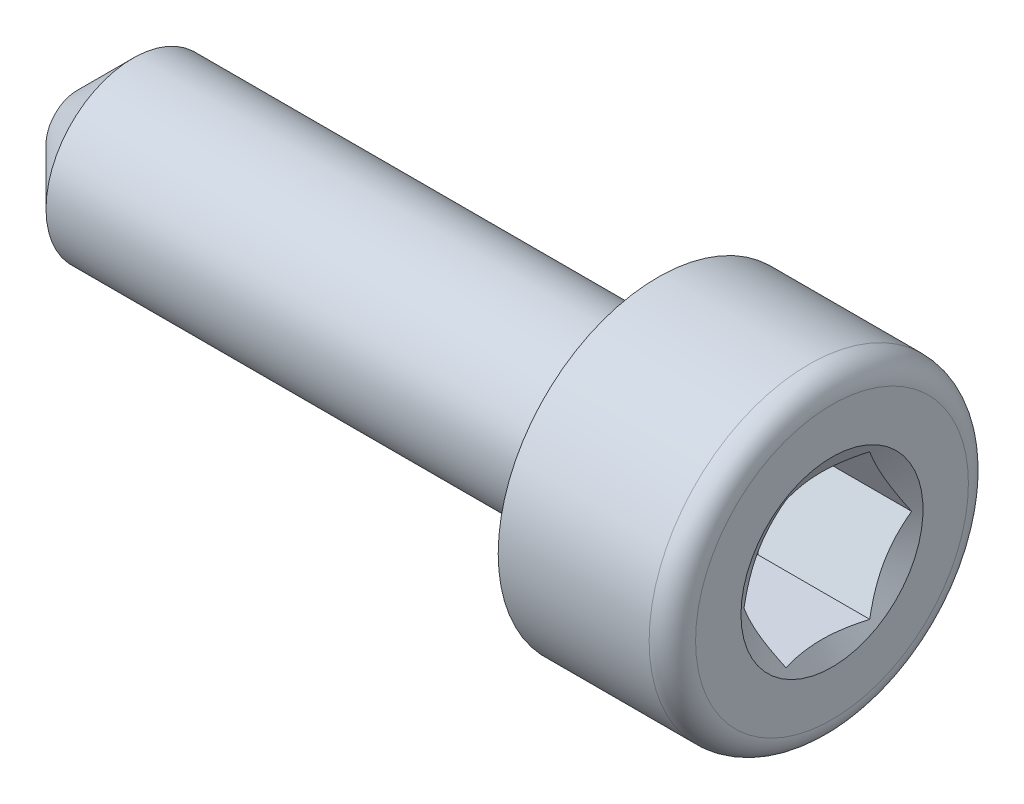
ISO-10303-21;
HEADER;
FILE_DESCRIPTION(('STEP AP214'),'2;1');
FILE_NAME('part.step','',(''),(''),'','','');
FILE_SCHEMA(('AUTOMOTIVE_DESIGN { 1 0 10303 214 1 1 1 1 }'));
ENDSEC;
DATA;
#1=APPLICATION_CONTEXT('core data for automotive mechanical design processes');
#2=APPLICATION_PROTOCOL_DEFINITION('international standard','automotive_design',2000,#1);
#3=PRODUCT_CONTEXT('',#1,'mechanical');
#4=PRODUCT('Part','Part','',(#3));
#5=PRODUCT_RELATED_PRODUCT_CATEGORY('part','',(#4));
#6=PRODUCT_DEFINITION_FORMATION('','',#4);
#7=PRODUCT_DEFINITION_CONTEXT('part definition',#1,'design');
#8=PRODUCT_DEFINITION('design','',#6,#7);
#9=PRODUCT_DEFINITION_SHAPE('','',#8);
#10=(LENGTH_UNIT() NAMED_UNIT(*) SI_UNIT(.MILLI.,.METRE.));
#11=(NAMED_UNIT(*) PLANE_ANGLE_UNIT() SI_UNIT($,.RADIAN.));
#12=(NAMED_UNIT(*) SI_UNIT($,.STERADIAN.) SOLID_ANGLE_UNIT());
#13=UNCERTAINTY_MEASURE_WITH_UNIT(LENGTH_MEASURE(1.E-05),#10,'distance_accuracy_value','');
#14=(GEOMETRIC_REPRESENTATION_CONTEXT(3) GLOBAL_UNCERTAINTY_ASSIGNED_CONTEXT((#13)) GLOBAL_UNIT_ASSIGNED_CONTEXT((#10,
#11,#12)) REPRESENTATION_CONTEXT('',''));
#15=CARTESIAN_POINT('',(0.,0.,0.));
#16=DIRECTION('',(0.,0.,1.));
#17=DIRECTION('',(1.,0.,0.));
#18=AXIS2_PLACEMENT_3D('',#15,#16,#17);
#19=CARTESIAN_POINT('',(68.6597400940086,-52.83000020762,146.720000096603));
#20=DIRECTION('',(1.,0.,0.));
#21=DIRECTION('',(0.,0.,-1.));
#22=AXIS2_PLACEMENT_3D('',#19,#20,#21);
#23=CONICAL_SURFACE('',#22,1.16376043070346,1.0471975511966);
#24=CARTESIAN_POINT('',(68.5212187011892,-52.82987220762,147.643834428141));
#25=CARTESIAN_POINT('',(68.5094934136353,-52.8650295227385,147.623536342794));
#26=CARTESIAN_POINT('',(68.4988293440446,-52.9004903107254,147.603063047304));
#27=CARTESIAN_POINT('',(68.4802143030994,-52.9720260427197,147.56176187318));
#28=CARTESIAN_POINT('',(68.4722699184489,-53.0081022586699,147.54093326019));
#29=CARTESIAN_POINT('',(68.4599022297053,-53.0798075510724,147.499534190319));
#30=CARTESIAN_POINT('',(68.4553966307068,-53.1154255890437,147.478970106508));
#31=CARTESIAN_POINT('',(68.4500159862293,-53.1868294261116,147.437745081956));
#32=CARTESIAN_POINT('',(68.4491364871196,-53.2226149653376,147.417084291251));
#33=CARTESIAN_POINT('',(68.450957365331,-53.2894932771785,147.378472079907));
#34=CARTESIAN_POINT('',(68.4532106526512,-53.3205960155447,147.360514905538));
#35=CARTESIAN_POINT('',(68.4603549815272,-53.3825988394103,147.324717558489));
#36=CARTESIAN_POINT('',(68.4652484681686,-53.4134987101429,147.306877509804));
#37=CARTESIAN_POINT('',(68.4774828804124,-53.4756295732868,147.271006239242));
#38=CARTESIAN_POINT('',(68.4848757138705,-53.5068526942453,147.252979561952));
#39=CARTESIAN_POINT('',(68.5016549508066,-53.5688330090869,147.217195210494));
#40=CARTESIAN_POINT('',(68.511037406771,-53.5995909982291,147.199437077183));
#41=CARTESIAN_POINT('',(68.5212187011892,-53.63012820762,147.181806411121));
#42=B_SPLINE_CURVE_WITH_KNOTS('',3,(#24,#25,#26,#27,#28,#29,#30,#31,#32,#33,#34,#35,#36,#37,#38,
#39,#40,#41),.UNSPECIFIED.,.F.,.F.,(4,2,2,2,2,2,2,2,4),(0.,0.126816525492999,0.253938045715125,
0.377912715180204,0.501735071636374,0.609587236168516,0.717539454345454,0.827887554272333,
0.938018732725722),.UNSPECIFIED.);
#43=CARTESIAN_POINT('',(68.521176029403,-52.83000020762,147.643760527307));
#44=VERTEX_POINT('',#43);
#45=CARTESIAN_POINT('',(68.521176029403,-53.63000020762,147.181880311955));
#46=VERTEX_POINT('',#45);
#47=EDGE_CURVE('E160',#44,#46,#42,.T.);
#48=ORIENTED_EDGE('',*,*,#47,.F.);
#49=CARTESIAN_POINT('',(68.5212187011892,-52.02987220762,147.181806411121));
#50=CARTESIAN_POINT('',(68.5094934136352,-52.0650295227386,147.202104496468));
#51=CARTESIAN_POINT('',(68.4988293440446,-52.1004903107254,147.222577791958));
#52=CARTESIAN_POINT('',(68.4802143030994,-52.1720260427198,147.263878966082));
#53=CARTESIAN_POINT('',(68.4722699184489,-52.2081022586699,147.284707579072));
#54=CARTESIAN_POINT('',(68.4599022297053,-52.2798075510725,147.326106648943));
#55=CARTESIAN_POINT('',(68.4553966307068,-52.3154255890438,147.346670732754));
#56=CARTESIAN_POINT('',(68.4500159862293,-52.3868294261117,147.387895757306));
#57=CARTESIAN_POINT('',(68.4491364871196,-52.4226149653377,147.408556548011));
#58=CARTESIAN_POINT('',(68.450957365331,-52.4894932771785,147.447168759356));
#59=CARTESIAN_POINT('',(68.4532106526512,-52.5205960155447,147.465125933724));
#60=CARTESIAN_POINT('',(68.4603549815272,-52.5825988394104,147.500923280773));
#61=CARTESIAN_POINT('',(68.4652484681686,-52.6134987101429,147.518763329458));
#62=CARTESIAN_POINT('',(68.4774828804124,-52.6756295732868,147.55463460002));
#63=CARTESIAN_POINT('',(68.4848757138705,-52.7068526942454,147.57266127731));
#64=CARTESIAN_POINT('',(68.5016549508066,-52.7688330090869,147.608445628768));
#65=CARTESIAN_POINT('',(68.511037406771,-52.7995909982291,147.626203762079));
#66=CARTESIAN_POINT('',(68.5212187011892,-52.83012820762,147.643834428141));
#67=B_SPLINE_CURVE_WITH_KNOTS('',3,(#49,#50,#51,#52,#53,#54,#55,#56,#57,#58,#59,#60,#61,#62,#63,
#64,#65,#66),.UNSPECIFIED.,.F.,.F.,(4,2,2,2,2,2,2,2,4),(0.,0.126816525493006,0.253938045715146,
0.377912715180235,0.501735071636427,0.609587236168529,0.717539454345456,0.827887554272352,
0.938018732725727),.UNSPECIFIED.);
#68=CARTESIAN_POINT('',(68.521176029403,-52.03000020762,147.181880311955));
#69=VERTEX_POINT('',#68);
#70=EDGE_CURVE('E11',#69,#44,#67,.T.);
#71=ORIENTED_EDGE('',*,*,#70,.F.);
#72=CARTESIAN_POINT('',(68.8241606292654,-52.03000020762,145.512406184663));
#73=CARTESIAN_POINT('',(68.8074657797416,-52.03000020762,145.547098522122));
#74=CARTESIAN_POINT('',(68.7909438843836,-52.03000020762,145.581873715875));
#75=CARTESIAN_POINT('',(68.7583365008573,-52.03000020762,145.651635233733));
#76=CARTESIAN_POINT('',(68.7422510890022,-52.03000020762,145.686621593468));
#77=CARTESIAN_POINT('',(68.6946083505296,-52.03000020762,145.792359507952));
#78=CARTESIAN_POINT('',(68.6638627236597,-52.03000020762,145.863483601709));
#79=CARTESIAN_POINT('',(68.6049839350816,-52.03000020762,146.009097983156));
#80=CARTESIAN_POINT('',(68.5769455311074,-52.03000020762,146.083627095829));
#81=CARTESIAN_POINT('',(68.5269198519533,-52.03000020762,146.234602012306));
#82=CARTESIAN_POINT('',(68.5049171935068,-52.03000020762,146.311042391316));
#83=CARTESIAN_POINT('',(68.4792653748251,-52.03000020762,146.427166410567));
#84=CARTESIAN_POINT('',(68.4719483389723,-52.03000020762,146.466029858478));
#85=CARTESIAN_POINT('',(68.460240914597,-52.03000020762,146.544204222171));
#86=CARTESIAN_POINT('',(68.4558503032918,-52.03000020762,146.58351510366));
#87=CARTESIAN_POINT('',(68.450402515354,-52.03000020762,146.661889349208));
#88=CARTESIAN_POINT('',(68.4493051409598,-52.03000020762,146.700949841373));
#89=CARTESIAN_POINT('',(68.4504288996582,-52.03000020762,146.779021773734));
#90=CARTESIAN_POINT('',(68.4526502202642,-52.03000020762,146.818033211034));
#91=CARTESIAN_POINT('',(68.4619659889334,-52.03000020762,146.913651013071));
#92=CARTESIAN_POINT('',(68.4708337598779,-52.03000020762,146.970085111015));
#93=CARTESIAN_POINT('',(68.493872845829,-52.03000020762,147.081870094715));
#94=CARTESIAN_POINT('',(68.5080504424478,-52.03000020762,147.137219615462));
#95=CARTESIAN_POINT('',(68.5405556851422,-52.03000020762,147.24802020667));
#96=CARTESIAN_POINT('',(68.558970085919,-52.03000020762,147.303445161441));
#97=CARTESIAN_POINT('',(68.5985233136134,-52.03000020762,147.413273679359));
#98=CARTESIAN_POINT('',(68.6196612381874,-52.03000020762,147.467677573989));
#99=CARTESIAN_POINT('',(68.6770129359438,-52.03000020762,147.608042163006));
#100=CARTESIAN_POINT('',(68.7146784839061,-52.03000020762,147.693403749214));
#101=CARTESIAN_POINT('',(68.7927399564154,-52.03000020762,147.8628710916));
#102=CARTESIAN_POINT('',(68.8331366567816,-52.03000020762,147.946976482584));
#103=CARTESIAN_POINT('',(68.9156710494868,-52.03000020762,148.11445236961));
#104=CARTESIAN_POINT('',(68.9578107974321,-52.03000020762,148.197821848631));
#105=CARTESIAN_POINT('',(69.0431925782374,-52.03000020762,148.363994931639));
#106=CARTESIAN_POINT('',(69.0864346495305,-52.03000020762,148.446798515767));
#107=CARTESIAN_POINT('',(69.1694321118793,-52.03000020762,148.603976195432));
#108=CARTESIAN_POINT('',(69.2091177782604,-52.03000020762,148.678387188479));
#109=CARTESIAN_POINT('',(69.2889422738617,-52.03000020762,148.826969296118));
#110=CARTESIAN_POINT('',(69.3290811215113,-52.03000020762,148.901140400797));
#111=CARTESIAN_POINT('',(69.4095892829879,-52.03000020762,149.049099090897));
#112=CARTESIAN_POINT('',(69.4499576881449,-52.03000020762,149.122887171336));
#113=CARTESIAN_POINT('',(69.530956500967,-52.03000020762,149.270314044254));
#114=CARTESIAN_POINT('',(69.5715868937745,-52.03000020762,149.343952844893));
#115=CARTESIAN_POINT('',(69.6123130966146,-52.03000020762,149.417538279232));
#116=B_SPLINE_CURVE_WITH_KNOTS('',3,(#72,#73,#74,#75,#76,#77,#78,#79,#80,#81,#82,#83,#84,#85,
#86,#87,#88,#89,#90,#91,#92,#93,#94,#95,#96,#97,#98,#99,#100,#101,#102,#103,#104,#105,#106,#107,
#108,#109,#110,#111,#112,#113,#114,#115),.UNSPECIFIED.,.F.,.F.,(4,2,2,2,2,2,2,2,2,2,2,2,2,2,2,2,
2,2,2,2,2,4),(0.,0.115499206954029,0.231018478934879,0.463412816308572,0.70217981961546,
0.940332502277009,1.05888018896878,1.17741884983488,1.29450460172914,1.41159696946407,
1.58262285981461,1.75385171904399,1.9289603523422,2.10401111804253,2.38382066740579,
2.66371003699703,2.94393946123019,3.22417866922427,3.47717373812532,3.73017913276501,
3.98250492526783,4.23481653181641),.UNSPECIFIED.);
#117=CARTESIAN_POINT('',(68.521176029403,-52.03000020762,146.258119881252));
#118=VERTEX_POINT('',#117);
#119=EDGE_CURVE('E54',#118,#69,#116,.T.);
#120=ORIENTED_EDGE('',*,*,#119,.F.);
#121=CARTESIAN_POINT('',(68.5212187011892,-52.83012820762,145.796165765066));
#122=CARTESIAN_POINT('',(68.5094934136352,-52.7949708925015,145.816463850413));
#123=CARTESIAN_POINT('',(68.4988293440446,-52.7595101045147,145.836937145903));
#124=CARTESIAN_POINT('',(68.4802143030994,-52.6879743725203,145.878238320027));
#125=CARTESIAN_POINT('',(68.4722699184489,-52.6518981565702,145.899066933017));
#126=CARTESIAN_POINT('',(68.4599022297053,-52.5801928641677,145.940466002888));
#127=CARTESIAN_POINT('',(68.4553966307067,-52.5445748261964,145.961030086699));
#128=CARTESIAN_POINT('',(68.4500159862293,-52.4731709891285,146.002255111251));
#129=CARTESIAN_POINT('',(68.4491364871196,-52.4373854499024,146.022915901956));
#130=CARTESIAN_POINT('',(68.450957365331,-52.3705071380616,146.0615281133));
#131=CARTESIAN_POINT('',(68.4532106526512,-52.3394043996954,146.079485287669));
#132=CARTESIAN_POINT('',(68.4603549815271,-52.2774015758298,146.115282634718));
#133=CARTESIAN_POINT('',(68.4652484681685,-52.2465017050972,146.133122683403));
#134=CARTESIAN_POINT('',(68.4774828804123,-52.1843708419533,146.168993953965));
#135=CARTESIAN_POINT('',(68.4848757138705,-52.1531477209947,146.187020631255));
#136=CARTESIAN_POINT('',(68.5016549508066,-52.0911674061532,146.222804982713));
#137=CARTESIAN_POINT('',(68.511037406771,-52.060409417011,146.240563116024));
#138=CARTESIAN_POINT('',(68.5212187011892,-52.02987220762,146.258193782086));
#139=B_SPLINE_CURVE_WITH_KNOTS('',3,(#121,#122,#123,#124,#125,#126,#127,#128,#129,#130,#131,
#132,#133,#134,#135,#136,#137,#138),.UNSPECIFIED.,.F.,.F.,(4,2,2,2,2,2,2,2,4),(0.,
0.126816525492994,0.253938045715109,0.377912715180201,0.501735071636375,0.609587236168512,
0.717539454345442,0.827887554272372,0.938018732725732),.UNSPECIFIED.);
#140=CARTESIAN_POINT('',(68.521176029403,-52.83000020762,145.7962396659));
#141=VERTEX_POINT('',#140);
#142=EDGE_CURVE('E198',#141,#118,#139,.T.);
#143=ORIENTED_EDGE('',*,*,#142,.F.);
#144=CARTESIAN_POINT('',(68.5212187011892,-53.63012820762,146.258193782086));
#145=CARTESIAN_POINT('',(68.5094934136352,-53.5949708925015,146.237895696739));
#146=CARTESIAN_POINT('',(68.4988293440446,-53.5595101045147,146.217422401249));
#147=CARTESIAN_POINT('',(68.4802143030994,-53.4879743725203,146.176121227125));
#148=CARTESIAN_POINT('',(68.4722699184489,-53.4518981565702,146.155292614135));
#149=CARTESIAN_POINT('',(68.4599022297053,-53.3801928641676,146.113893544264));
#150=CARTESIAN_POINT('',(68.4553966307067,-53.3445748261963,146.093329460453));
#151=CARTESIAN_POINT('',(68.4500159862293,-53.2731709891284,146.052104435901));
#152=CARTESIAN_POINT('',(68.4491364871196,-53.2373854499024,146.031443645196));
#153=CARTESIAN_POINT('',(68.450957365331,-53.1705071380616,145.992831433851));
#154=CARTESIAN_POINT('',(68.4532106526512,-53.1394043996954,145.974874259483));
#155=CARTESIAN_POINT('',(68.4603549815271,-53.0774015758297,145.939076912434));
#156=CARTESIAN_POINT('',(68.4652484681685,-53.0465017050972,145.921236863748));
#157=CARTESIAN_POINT('',(68.4774828804123,-52.9843708419532,145.885365593187));
#158=CARTESIAN_POINT('',(68.4848757138705,-52.9531477209947,145.867338915897));
#159=CARTESIAN_POINT('',(68.5016549508066,-52.8911674061531,145.831554564439));
#160=CARTESIAN_POINT('',(68.511037406771,-52.8604094170109,145.813796431128));
#161=CARTESIAN_POINT('',(68.5212187011892,-52.82987220762,145.796165765066));
#162=B_SPLINE_CURVE_WITH_KNOTS('',3,(#144,#145,#146,#147,#148,#149,#150,#151,#152,#153,#154,
#155,#156,#157,#158,#159,#160,#161),.UNSPECIFIED.,.F.,.F.,(4,2,2,2,2,2,2,2,4),(0.,
0.126816525492994,0.253938045715109,0.377912715180208,0.501735071636387,0.609587236168525,
0.717539454345451,0.827887554272353,0.938018732725731),.UNSPECIFIED.);
#163=CARTESIAN_POINT('',(68.521176029403,-53.63000020762,146.258119881252));
#164=VERTEX_POINT('',#163);
#165=EDGE_CURVE('E192',#164,#141,#162,.T.);
#166=ORIENTED_EDGE('',*,*,#165,.F.);
#167=CARTESIAN_POINT('',(68.8241606292654,-53.63000020762,145.512406184664));
#168=CARTESIAN_POINT('',(68.8074657797416,-53.63000020762,145.547098522122));
#169=CARTESIAN_POINT('',(68.7909438843836,-53.63000020762,145.581873715875));
#170=CARTESIAN_POINT('',(68.7583365008573,-53.63000020762,145.651635233733));
#171=CARTESIAN_POINT('',(68.7422510890022,-53.63000020762,145.686621593468));
#172=CARTESIAN_POINT('',(68.6946083505296,-53.63000020762,145.792359507952));
#173=CARTESIAN_POINT('',(68.6638627236597,-53.63000020762,145.863483601709));
#174=CARTESIAN_POINT('',(68.6049839350816,-53.63000020762,146.009097983157));
#175=CARTESIAN_POINT('',(68.5769455311074,-53.63000020762,146.083627095829));
#176=CARTESIAN_POINT('',(68.5269198519532,-53.63000020762,146.234602012306));
#177=CARTESIAN_POINT('',(68.5049171935067,-53.63000020762,146.311042391316));
#178=CARTESIAN_POINT('',(68.479265374825,-53.63000020762,146.427166410567));
#179=CARTESIAN_POINT('',(68.4719483389722,-53.63000020762,146.466029858478));
#180=CARTESIAN_POINT('',(68.460240914597,-53.63000020762,146.544204222171));
#181=CARTESIAN_POINT('',(68.4558503032918,-53.63000020762,146.58351510366));
#182=CARTESIAN_POINT('',(68.450402515354,-53.63000020762,146.661889349208));
#183=CARTESIAN_POINT('',(68.4493051409598,-53.63000020762,146.700949841373));
#184=CARTESIAN_POINT('',(68.4504288996582,-53.63000020762,146.779021773734));
#185=CARTESIAN_POINT('',(68.4526502202642,-53.63000020762,146.818033211034));
#186=CARTESIAN_POINT('',(68.4619659889334,-53.63000020762,146.913651013071));
#187=CARTESIAN_POINT('',(68.4708337598779,-53.63000020762,146.970085111015));
#188=CARTESIAN_POINT('',(68.493872845829,-53.63000020762,147.081870094716));
#189=CARTESIAN_POINT('',(68.5080504424478,-53.63000020762,147.137219615462));
#190=CARTESIAN_POINT('',(68.5405556851422,-53.63000020762,147.24802020667));
#191=CARTESIAN_POINT('',(68.5589700859191,-53.63000020762,147.303445161441));
#192=CARTESIAN_POINT('',(68.5985233136135,-53.63000020762,147.413273679359));
#193=CARTESIAN_POINT('',(68.6196612381874,-53.63000020762,147.467677573989));
#194=CARTESIAN_POINT('',(68.6770129359438,-53.63000020762,147.608042163006));
#195=CARTESIAN_POINT('',(68.7146784839062,-53.63000020762,147.693403749214));
#196=CARTESIAN_POINT('',(68.7927399564155,-53.6300002076201,147.8628710916));
#197=CARTESIAN_POINT('',(68.8331366567817,-53.63000020762,147.946976482585));
#198=CARTESIAN_POINT('',(68.9156710494868,-53.63000020762,148.11445236961));
#199=CARTESIAN_POINT('',(68.9578107974321,-53.6300002076201,148.197821848631));
#200=CARTESIAN_POINT('',(69.0431925782374,-53.6300002076201,148.363994931639));
#201=CARTESIAN_POINT('',(69.0864346495305,-53.6300002076201,148.446798515767));
#202=CARTESIAN_POINT('',(69.1694321118793,-53.6300002076201,148.603976195432));
#203=CARTESIAN_POINT('',(69.2091177782604,-53.6300002076201,148.678387188479));
#204=CARTESIAN_POINT('',(69.2889422738617,-53.6300002076201,148.826969296118));
#205=CARTESIAN_POINT('',(69.3290811215113,-53.6300002076201,148.901140400797));
#206=CARTESIAN_POINT('',(69.4095892829879,-53.6300002076201,149.049099090897));
#207=CARTESIAN_POINT('',(69.4499576881449,-53.6300002076201,149.122887171336));
#208=CARTESIAN_POINT('',(69.530956500967,-53.6300002076201,149.270314044254));
#209=CARTESIAN_POINT('',(69.5715868937745,-53.63000020762,149.343952844893));
#210=CARTESIAN_POINT('',(69.6123130966146,-53.63000020762,149.417538279232));
#211=B_SPLINE_CURVE_WITH_KNOTS('',3,(#167,#168,#169,#170,#171,#172,#173,#174,#175,#176,#177,
#178,#179,#180,#181,#182,#183,#184,#185,#186,#187,#188,#189,#190,#191,#192,#193,#194,#195,#196,
#197,#198,#199,#200,#201,#202,#203,#204,#205,#206,#207,#208,#209,#210),.UNSPECIFIED.,.F.,.F.,(4,
2,2,2,2,2,2,2,2,2,2,2,2,2,2,2,2,2,2,2,2,4),(0.,0.115499206954021,0.231018478934877,
0.463412816308565,0.702179819615392,0.940332502276902,1.05888018896866,1.17741884983476,
1.29450460172902,1.41159696946395,1.58262285981449,1.75385171904393,1.92896035234214,
2.10401111804251,2.38382066740573,2.66371003699694,2.94393946123004,3.22417866922409,
3.47717373812514,3.73017913276486,3.98250492526769,4.23481653181629),.UNSPECIFIED.);
#212=EDGE_CURVE('E167',#46,#164,#211,.F.);
#213=ORIENTED_EDGE('',*,*,#212,.F.);
#214=EDGE_LOOP('',(#48,#71,#120,#143,#166,#213));
#215=FACE_BOUND('',#214,.T.);
#216=CARTESIAN_POINT('',(68.5673640509382,-52.83000020762,146.720000096603));
#217=DIRECTION('',(-1.,0.,0.));
#218=DIRECTION('',(0.,0.,1.));
#219=AXIS2_PLACEMENT_3D('',#216,#217,#218);
#220=CIRCLE('',#219,1.00376043070342);
#221=CARTESIAN_POINT('',(68.5673640509382,-52.83000020762,147.723760527307));
#222=VERTEX_POINT('',#221);
#223=EDGE_CURVE('E156',#222,#222,#220,.T.);
#224=ORIENTED_EDGE('',*,*,#223,.F.);
#225=EDGE_LOOP('',(#224));
#226=FACE_BOUND('',#225,.T.);
#227=ADVANCED_FACE('F40',(#215,#226),#23,.F.);
#228=CARTESIAN_POINT('',(60.2473640509382,-52.83000020762,147.065600096603));
#229=DIRECTION('',(1.,0.,0.));
#230=DIRECTION('',(0.,0.,-1.));
#231=AXIS2_PLACEMENT_3D('',#228,#229,#230);
#232=PLANE('',#231);
#233=CARTESIAN_POINT('',(60.2473640509382,-52.83000020762,146.720000096603));
#234=DIRECTION('',(-1.,0.,0.));
#235=DIRECTION('',(0.,0.,1.));
#236=AXIS2_PLACEMENT_3D('',#233,#234,#235);
#237=CIRCLE('',#236,0.345600000000026);
#238=CARTESIAN_POINT('',(60.2473640509382,-52.83000020762,147.065600096603));
#239=VERTEX_POINT('',#238);
#240=EDGE_CURVE('E152',#239,#239,#237,.T.);
#241=ORIENTED_EDGE('',*,*,#240,.T.);
#242=EDGE_LOOP('',(#241));
#243=FACE_BOUND('',#242,.T.);
#244=ADVANCED_FACE('F42',(#243),#232,.F.);
#245=CARTESIAN_POINT('',(60.8617640509382,-52.83000020762,146.720000096603));
#246=DIRECTION('',(1.,0.,0.));
#247=DIRECTION('',(0.,0.,-1.));
#248=AXIS2_PLACEMENT_3D('',#245,#246,#247);
#249=CONICAL_SURFACE('',#248,0.96,0.785398163397434);
#250=ORIENTED_EDGE('',*,*,#240,.F.);
#251=EDGE_LOOP('',(#250));
#252=FACE_BOUND('',#251,.T.);
#253=CARTESIAN_POINT('',(60.8617640509382,-52.83000020762,146.720000096603));
#254=DIRECTION('',(-1.,0.,0.));
#255=DIRECTION('',(0.,0.,1.));
#256=AXIS2_PLACEMENT_3D('',#253,#254,#255);
#257=CIRCLE('',#256,0.96);
#258=CARTESIAN_POINT('',(60.8617640509382,-52.83000020762,147.680000096603));
#259=VERTEX_POINT('',#258);
#260=EDGE_CURVE('E148',#259,#259,#257,.T.);
#261=ORIENTED_EDGE('',*,*,#260,.T.);
#262=EDGE_LOOP('',(#261));
#263=FACE_BOUND('',#262,.T.);
#264=ADVANCED_FACE('F223',(#252,#263),#249,.T.);
#265=CARTESIAN_POINT('',(60.2473640509382,-52.83000020762,146.720000096603));
#266=DIRECTION('',(-1.,0.,0.));
#267=DIRECTION('',(0.,0.,1.));
#268=AXIS2_PLACEMENT_3D('',#265,#266,#267);
#269=CYLINDRICAL_SURFACE('',#268,0.96);
#270=ORIENTED_EDGE('',*,*,#260,.F.);
#271=EDGE_LOOP('',(#270));
#272=FACE_BOUND('',#271,.T.);
#273=CARTESIAN_POINT('',(66.5193640509382,-52.83000020762,146.720000096603));
#274=DIRECTION('',(-1.,0.,0.));
#275=DIRECTION('',(0.,0.,1.));
#276=AXIS2_PLACEMENT_3D('',#273,#274,#275);
#277=CIRCLE('',#276,0.96);
#278=CARTESIAN_POINT('',(66.5193640509382,-52.83000020762,147.680000096603));
#279=VERTEX_POINT('',#278);
#280=EDGE_CURVE('E144',#279,#279,#277,.T.);
#281=ORIENTED_EDGE('',*,*,#280,.T.);
#282=EDGE_LOOP('',(#281));
#283=FACE_BOUND('',#282,.T.);
#284=ADVANCED_FACE('F287',(#272,#283),#269,.T.);
#285=CARTESIAN_POINT('',(66.5193640509382,-52.83000020762,146.720000096603));
#286=DIRECTION('',(-1.,0.,0.));
#287=DIRECTION('',(0.,0.,1.));
#288=AXIS2_PLACEMENT_3D('',#285,#286,#287);
#289=TOROIDAL_SURFACE('',#288,1.088,0.128000000000004);
#290=ORIENTED_EDGE('',*,*,#280,.F.);
#291=EDGE_LOOP('',(#290));
#292=FACE_BOUND('',#291,.T.);
#293=CARTESIAN_POINT('',(66.6473640509382,-52.83000020762,146.720000096603));
#294=DIRECTION('',(-1.,0.,0.));
#295=DIRECTION('',(0.,0.,1.));
#296=AXIS2_PLACEMENT_3D('',#293,#294,#295);
#297=CIRCLE('',#296,1.088);
#298=CARTESIAN_POINT('',(66.6473640509382,-52.83000020762,147.808000096603));
#299=VERTEX_POINT('',#298);
#300=EDGE_CURVE('E140',#299,#299,#297,.T.);
#301=ORIENTED_EDGE('',*,*,#300,.T.);
#302=EDGE_LOOP('',(#301));
#303=FACE_BOUND('',#302,.T.);
#304=ADVANCED_FACE('F295',(#292,#303),#289,.F.);
#305=CARTESIAN_POINT('',(66.6473640509382,-52.83000020762,148.480000096603));
#306=DIRECTION('',(1.,0.,0.));
#307=DIRECTION('',(0.,0.,-1.));
#308=AXIS2_PLACEMENT_3D('',#305,#306,#307);
#309=PLANE('',#308);
#310=ORIENTED_EDGE('',*,*,#300,.F.);
#311=EDGE_LOOP('',(#310));
#312=FACE_BOUND('',#311,.T.);
#313=CARTESIAN_POINT('',(66.6473640509382,-52.83000020762,146.720000096603));
#314=DIRECTION('',(-1.,0.,0.));
#315=DIRECTION('',(0.,0.,1.));
#316=AXIS2_PLACEMENT_3D('',#313,#314,#315);
#317=CIRCLE('',#316,1.76);
#318=CARTESIAN_POINT('',(66.6473640509382,-52.83000020762,148.480000096603));
#319=VERTEX_POINT('',#318);
#320=EDGE_CURVE('E136',#319,#319,#317,.T.);
#321=ORIENTED_EDGE('',*,*,#320,.T.);
#322=EDGE_LOOP('',(#321));
#323=FACE_BOUND('',#322,.T.);
#324=ADVANCED_FACE('F306',(#312,#323),#309,.F.);
#325=CARTESIAN_POINT('',(60.2473640509382,-52.83000020762,146.720000096603));
#326=DIRECTION('',(-1.,0.,0.));
#327=DIRECTION('',(0.,0.,1.));
#328=AXIS2_PLACEMENT_3D('',#325,#326,#327);
#329=CYLINDRICAL_SURFACE('',#328,1.76);
#330=ORIENTED_EDGE('',*,*,#320,.F.);
#331=EDGE_LOOP('',(#330));
#332=FACE_BOUND('',#331,.T.);
#333=CARTESIAN_POINT('',(68.3113640509382,-52.83000020762,146.720000096603));
#334=DIRECTION('',(-1.,0.,0.));
#335=DIRECTION('',(0.,0.,1.));
#336=AXIS2_PLACEMENT_3D('',#333,#334,#335);
#337=CIRCLE('',#336,1.76);
#338=CARTESIAN_POINT('',(68.3113640509382,-52.83000020762,148.480000096603));
#339=VERTEX_POINT('',#338);
#340=EDGE_CURVE('E126',#339,#339,#337,.T.);
#341=ORIENTED_EDGE('',*,*,#340,.T.);
#342=EDGE_LOOP('',(#341));
#343=FACE_BOUND('',#342,.T.);
#344=ADVANCED_FACE('F315',(#332,#343),#329,.T.);
#345=CARTESIAN_POINT('',(68.3113640509382,-52.83000020762,146.720000096603));
#346=DIRECTION('',(-1.,0.,0.));
#347=DIRECTION('',(0.,0.,1.));
#348=AXIS2_PLACEMENT_3D('',#345,#346,#347);
#349=TOROIDAL_SURFACE('',#348,1.504,0.256000000000007);
#350=ORIENTED_EDGE('',*,*,#340,.F.);
#351=EDGE_LOOP('',(#350));
#352=FACE_BOUND('',#351,.T.);
#353=CARTESIAN_POINT('',(68.5673640509382,-52.83000020762,146.720000096603));
#354=DIRECTION('',(-1.,0.,0.));
#355=DIRECTION('',(0.,0.,1.));
#356=AXIS2_PLACEMENT_3D('',#353,#354,#355);
#357=CIRCLE('',#356,1.504);
#358=CARTESIAN_POINT('',(68.5673640509382,-52.83000020762,148.224000096603));
#359=VERTEX_POINT('',#358);
#360=EDGE_CURVE('E118',#359,#359,#357,.T.);
#361=ORIENTED_EDGE('',*,*,#360,.T.);
#362=EDGE_LOOP('',(#361));
#363=FACE_BOUND('',#362,.T.);
#364=ADVANCED_FACE('F216',(#352,#363),#349,.T.);
#365=CARTESIAN_POINT('',(68.5673640509382,-52.83000020762,146.720000096603));
#366=DIRECTION('',(-1.,0.,0.));
#367=DIRECTION('',(0.,0.,1.));
#368=AXIS2_PLACEMENT_3D('',#365,#366,#367);
#369=PLANE('',#368);
#370=ORIENTED_EDGE('',*,*,#360,.F.);
#371=EDGE_LOOP('',(#370));
#372=FACE_BOUND('',#371,.T.);
#373=ORIENTED_EDGE('',*,*,#223,.T.);
#374=EDGE_LOOP('',(#373));
#375=FACE_BOUND('',#374,.T.);
#376=ADVANCED_FACE('F212',(#372,#375),#369,.F.);
#377=CARTESIAN_POINT('',(60.2473640509382,-52.83000020762,147.643760527307));
#378=DIRECTION('',(0.,-0.50000000000001,-0.866025403784433));
#379=DIRECTION('',(0.,0.866025403784433,-0.500000000000011));
#380=AXIS2_PLACEMENT_3D('',#377,#378,#379);
#381=PLANE('',#380);
#382=ORIENTED_EDGE('',*,*,#70,.T.);
#383=DIRECTION('',(1.,0.,0.));
#384=VECTOR('',#383,1.);
#385=CARTESIAN_POINT('',(60.2473640509382,-52.83000020762,147.643760527307));
#386=LINE('',#385,#384);
#387=CARTESIAN_POINT('',(67.2873640509382,-52.83000020762,147.643760527307));
#388=VERTEX_POINT('',#387);
#389=EDGE_CURVE('E61',#388,#44,#386,.T.);
#390=ORIENTED_EDGE('',*,*,#389,.F.);
#391=CARTESIAN_POINT('',(68.8260307176048,-52.43000020762,147.412820419631));
#392=DIRECTION('',(0.,-0.50000000000001,-0.866025403784433));
#393=DIRECTION('',(0.,0.866025403784433,-0.500000000000011));
#394=AXIS2_PLACEMENT_3D('',#391,#392,#393);
#395=CIRCLE('',#394,1.60649570321379);
#396=CARTESIAN_POINT('',(67.2873640509382,-52.03000020762,147.181880311955));
#397=VERTEX_POINT('',#396);
#398=EDGE_CURVE('E100',#388,#397,#395,.T.);
#399=ORIENTED_EDGE('',*,*,#398,.T.);
#400=DIRECTION('',(1.,0.,0.));
#401=VECTOR('',#400,1.);
#402=CARTESIAN_POINT('',(60.2473640509382,-52.03000020762,147.181880311955));
#403=LINE('',#402,#401);
#404=EDGE_CURVE('E119',#397,#69,#403,.T.);
#405=ORIENTED_EDGE('',*,*,#404,.T.);
#406=EDGE_LOOP('',(#382,#390,#399,#405));
#407=FACE_BOUND('',#406,.T.);
#408=ADVANCED_FACE('F99',(#407),#381,.T.);
#409=CARTESIAN_POINT('',(60.2473640509382,-52.03000020762,147.181880311955));
#410=DIRECTION('',(0.,-1.,0.));
#411=DIRECTION('',(0.,0.,-1.));
#412=AXIS2_PLACEMENT_3D('',#409,#410,#411);
#413=PLANE('',#412);
#414=ORIENTED_EDGE('',*,*,#119,.T.);
#415=ORIENTED_EDGE('',*,*,#404,.F.);
#416=CARTESIAN_POINT('',(68.8260307176048,-52.03000020762,146.720000096603));
#417=DIRECTION('',(0.,-1.,0.));
#418=DIRECTION('',(0.,0.,-1.));
#419=AXIS2_PLACEMENT_3D('',#416,#417,#418);
#420=CIRCLE('',#419,1.60649570321379);
#421=CARTESIAN_POINT('',(67.2873640509382,-52.03000020762,146.258119881252));
#422=VERTEX_POINT('',#421);
#423=EDGE_CURVE('E111',#397,#422,#420,.T.);
#424=ORIENTED_EDGE('',*,*,#423,.T.);
#425=DIRECTION('',(1.,0.,0.));
#426=VECTOR('',#425,1.);
#427=CARTESIAN_POINT('',(60.2473640509382,-52.03000020762,146.258119881252));
#428=LINE('',#427,#426);
#429=EDGE_CURVE('E129',#422,#118,#428,.T.);
#430=ORIENTED_EDGE('',*,*,#429,.T.);
#431=EDGE_LOOP('',(#414,#415,#424,#430));
#432=FACE_BOUND('',#431,.T.);
#433=ADVANCED_FACE('F207',(#432),#413,.T.);
#434=CARTESIAN_POINT('',(60.2473640509382,-52.03000020762,146.258119881252));
#435=DIRECTION('',(0.,-0.500000000000006,0.866025403784435));
#436=DIRECTION('',(0.,-0.866025403784435,-0.500000000000006));
#437=AXIS2_PLACEMENT_3D('',#434,#435,#436);
#438=PLANE('',#437);
#439=ORIENTED_EDGE('',*,*,#142,.T.);
#440=ORIENTED_EDGE('',*,*,#429,.F.);
#441=CARTESIAN_POINT('',(68.8260307176048,-52.43000020762,146.027179773576));
#442=DIRECTION('',(0.,-0.500000000000006,0.866025403784435));
#443=DIRECTION('',(0.,-0.866025403784435,-0.500000000000006));
#444=AXIS2_PLACEMENT_3D('',#441,#442,#443);
#445=CIRCLE('',#444,1.6064957032138);
#446=CARTESIAN_POINT('',(67.2873640509382,-52.83000020762,145.7962396659));
#447=VERTEX_POINT('',#446);
#448=EDGE_CURVE('E254',#422,#447,#445,.T.);
#449=ORIENTED_EDGE('',*,*,#448,.T.);
#450=DIRECTION('',(1.,0.,0.));
#451=VECTOR('',#450,1.);
#452=CARTESIAN_POINT('',(60.2473640509382,-52.83000020762,145.7962396659));
#453=LINE('',#452,#451);
#454=EDGE_CURVE('E240',#447,#141,#453,.T.);
#455=ORIENTED_EDGE('',*,*,#454,.T.);
#456=EDGE_LOOP('',(#439,#440,#449,#455));
#457=FACE_BOUND('',#456,.T.);
#458=ADVANCED_FACE('F188',(#457),#438,.T.);
#459=CARTESIAN_POINT('',(60.2473640509382,-52.83000020762,145.7962396659));
#460=DIRECTION('',(0.,0.50000000000001,0.866025403784433));
#461=DIRECTION('',(0.,-0.866025403784433,0.500000000000011));
#462=AXIS2_PLACEMENT_3D('',#459,#460,#461);
#463=PLANE('',#462);
#464=ORIENTED_EDGE('',*,*,#165,.T.);
#465=ORIENTED_EDGE('',*,*,#454,.F.);
#466=CARTESIAN_POINT('',(68.8260307176048,-53.23000020762,146.027179773576));
#467=DIRECTION('',(0.,0.50000000000001,0.866025403784433));
#468=DIRECTION('',(0.,-0.866025403784433,0.500000000000011));
#469=AXIS2_PLACEMENT_3D('',#466,#467,#468);
#470=CIRCLE('',#469,1.60649570321379);
#471=CARTESIAN_POINT('',(67.2873640509382,-53.63000020762,146.258119881252));
#472=VERTEX_POINT('',#471);
#473=EDGE_CURVE('E256',#447,#472,#470,.T.);
#474=ORIENTED_EDGE('',*,*,#473,.T.);
#475=DIRECTION('',(1.,0.,0.));
#476=VECTOR('',#475,1.);
#477=CARTESIAN_POINT('',(60.2473640509382,-53.63000020762,146.258119881252));
#478=LINE('',#477,#476);
#479=EDGE_CURVE('E234',#472,#164,#478,.T.);
#480=ORIENTED_EDGE('',*,*,#479,.T.);
#481=EDGE_LOOP('',(#464,#465,#474,#480));
#482=FACE_BOUND('',#481,.T.);
#483=ADVANCED_FACE('F183',(#482),#463,.T.);
#484=CARTESIAN_POINT('',(60.2473640509382,-53.63000020762,146.258119881252));
#485=DIRECTION('',(0.,1.,0.));
#486=DIRECTION('',(0.,0.,1.));
#487=AXIS2_PLACEMENT_3D('',#484,#485,#486);
#488=PLANE('',#487);
#489=ORIENTED_EDGE('',*,*,#212,.T.);
#490=ORIENTED_EDGE('',*,*,#479,.F.);
#491=CARTESIAN_POINT('',(68.8260307176048,-53.63000020762,146.720000096603));
#492=DIRECTION('',(0.,1.,0.));
#493=DIRECTION('',(0.,0.,1.));
#494=AXIS2_PLACEMENT_3D('',#491,#492,#493);
#495=CIRCLE('',#494,1.60649570321379);
#496=CARTESIAN_POINT('',(67.2873640509382,-53.63000020762,147.181880311955));
#497=VERTEX_POINT('',#496);
#498=EDGE_CURVE('E232',#472,#497,#495,.T.);
#499=ORIENTED_EDGE('',*,*,#498,.T.);
#500=DIRECTION('',(1.,0.,0.));
#501=VECTOR('',#500,1.);
#502=CARTESIAN_POINT('',(60.2473640509382,-53.63000020762,147.181880311955));
#503=LINE('',#502,#501);
#504=EDGE_CURVE('E104',#497,#46,#503,.T.);
#505=ORIENTED_EDGE('',*,*,#504,.T.);
#506=EDGE_LOOP('',(#489,#490,#499,#505));
#507=FACE_BOUND('',#506,.T.);
#508=ADVANCED_FACE('F179',(#507),#488,.T.);
#509=CARTESIAN_POINT('',(60.2473640509382,-53.63000020762,147.181880311955));
#510=DIRECTION('',(0.,0.5,-0.866025403784437));
#511=DIRECTION('',(0.,0.866025403784438,0.5));
#512=AXIS2_PLACEMENT_3D('',#509,#510,#511);
#513=PLANE('',#512);
#514=ORIENTED_EDGE('',*,*,#47,.T.);
#515=ORIENTED_EDGE('',*,*,#504,.F.);
#516=CARTESIAN_POINT('',(68.8260307176048,-53.23000020762,147.412820419631));
#517=DIRECTION('',(0.,0.5,-0.866025403784437));
#518=DIRECTION('',(0.,0.866025403784438,0.5));
#519=AXIS2_PLACEMENT_3D('',#516,#517,#518);
#520=CIRCLE('',#519,1.6064957032138);
#521=EDGE_CURVE('E108',#497,#388,#520,.T.);
#522=ORIENTED_EDGE('',*,*,#521,.T.);
#523=ORIENTED_EDGE('',*,*,#389,.T.);
#524=EDGE_LOOP('',(#514,#515,#522,#523));
#525=FACE_BOUND('',#524,.T.);
#526=ADVANCED_FACE('F114',(#525),#513,.T.);
#527=CARTESIAN_POINT('',(68.8260307176048,-52.83000020762,146.720000096603));
#528=DIRECTION('',(1.,0.,0.));
#529=DIRECTION('',(0.,0.,1.));
#530=AXIS2_PLACEMENT_3D('',#527,#528,#529);
#531=SPHERICAL_SURFACE('',#530,1.79466666666665);
#532=ORIENTED_EDGE('',*,*,#398,.F.);
#533=ORIENTED_EDGE('',*,*,#521,.F.);
#534=ORIENTED_EDGE('',*,*,#498,.F.);
#535=ORIENTED_EDGE('',*,*,#473,.F.);
#536=ORIENTED_EDGE('',*,*,#448,.F.);
#537=ORIENTED_EDGE('',*,*,#423,.F.);
#538=EDGE_LOOP('',(#532,#533,#534,#535,#536,#537));
#539=FACE_BOUND('',#538,.T.);
#540=ADVANCED_FACE('F107',(#539),#531,.F.);
#541=CLOSED_SHELL('',(#227,#244,#264,#284,#304,#324,#344,#364,#376,#408,#433,#458,#483,#508,
#526,#540));
#542=MANIFOLD_SOLID_BREP('B2',#541);
#543=ADVANCED_BREP_SHAPE_REPRESENTATION('',(#18,#542),#14);
#544=SHAPE_DEFINITION_REPRESENTATION(#9,#543);
ENDSEC;
END-ISO-10303-21;
